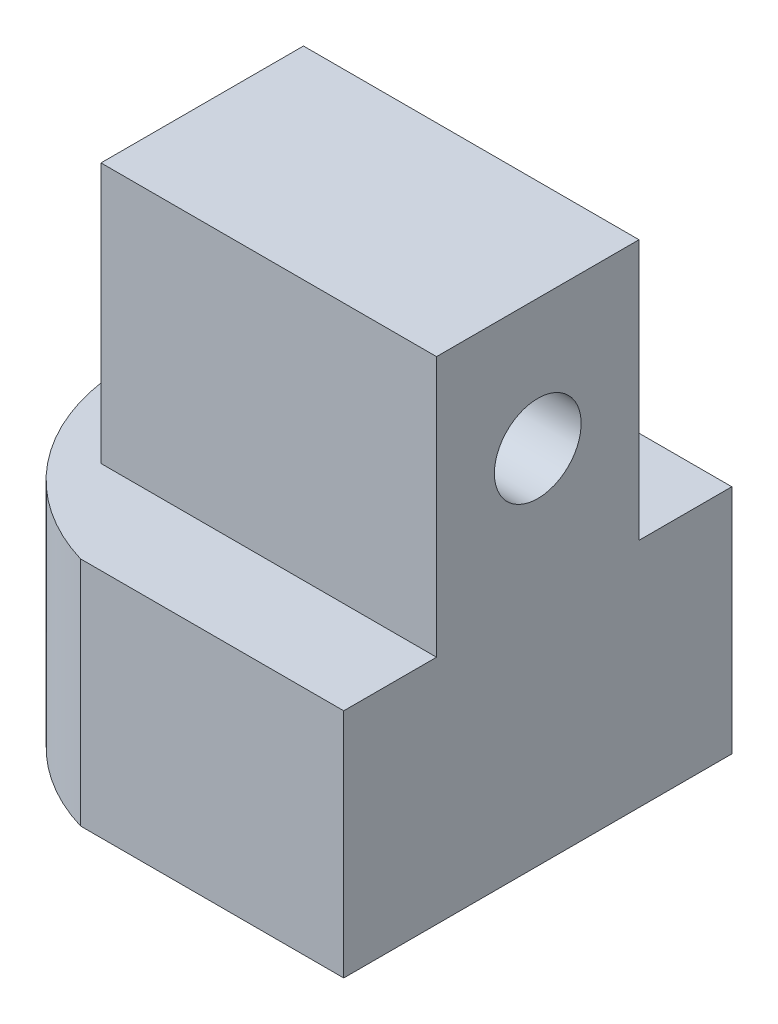
ISO-10303-21;
HEADER;
FILE_DESCRIPTION(('STEP AP214'),'2;1');
FILE_NAME('part.step','',(''),(''),'','','');
FILE_SCHEMA(('AUTOMOTIVE_DESIGN { 1 0 10303 214 1 1 1 1 }'));
ENDSEC;
DATA;
#1=APPLICATION_CONTEXT('core data for automotive mechanical design processes');
#2=APPLICATION_PROTOCOL_DEFINITION('international standard','automotive_design',2000,#1);
#3=PRODUCT_CONTEXT('',#1,'mechanical');
#4=PRODUCT('Part','Part','',(#3));
#5=PRODUCT_RELATED_PRODUCT_CATEGORY('part','',(#4));
#6=PRODUCT_DEFINITION_FORMATION('','',#4);
#7=PRODUCT_DEFINITION_CONTEXT('part definition',#1,'design');
#8=PRODUCT_DEFINITION('design','',#6,#7);
#9=PRODUCT_DEFINITION_SHAPE('','',#8);
#10=(LENGTH_UNIT() NAMED_UNIT(*) SI_UNIT(.MILLI.,.METRE.));
#11=(NAMED_UNIT(*) PLANE_ANGLE_UNIT() SI_UNIT($,.RADIAN.));
#12=(NAMED_UNIT(*) SI_UNIT($,.STERADIAN.) SOLID_ANGLE_UNIT());
#13=UNCERTAINTY_MEASURE_WITH_UNIT(LENGTH_MEASURE(1.E-05),#10,'distance_accuracy_value','');
#14=(GEOMETRIC_REPRESENTATION_CONTEXT(3) GLOBAL_UNCERTAINTY_ASSIGNED_CONTEXT((#13)) GLOBAL_UNIT_ASSIGNED_CONTEXT((#10,
#11,#12)) REPRESENTATION_CONTEXT('',''));
#15=CARTESIAN_POINT('',(0.,0.,0.));
#16=DIRECTION('',(0.,0.,1.));
#17=DIRECTION('',(1.,0.,0.));
#18=AXIS2_PLACEMENT_3D('',#15,#16,#17);
#19=CARTESIAN_POINT('',(0.,8.,0.));
#20=DIRECTION('',(0.,-1.,0.));
#21=DIRECTION('',(0.,0.,-1.));
#22=AXIS2_PLACEMENT_3D('',#19,#20,#21);
#23=PLANE('',#22);
#24=CARTESIAN_POINT('',(0.,8.,0.));
#25=DIRECTION('',(0.,1.,0.));
#26=DIRECTION('',(0.,0.,-1.));
#27=AXIS2_PLACEMENT_3D('',#24,#25,#26);
#28=CIRCLE('',#27,7.);
#29=CARTESIAN_POINT('',(-1.99999999999999,8.,-6.70820393249937));
#30=VERTEX_POINT('',#29);
#31=CARTESIAN_POINT('',(-1.99999999999999,8.,6.70820393249936));
#32=VERTEX_POINT('',#31);
#33=EDGE_CURVE('E149',#30,#32,#28,.T.);
#34=ORIENTED_EDGE('',*,*,#33,.T.);
#35=DIRECTION('',(1.,0.,0.));
#36=VECTOR('',#35,1.);
#37=CARTESIAN_POINT('',(2.,8.,6.70820393249937));
#38=LINE('',#37,#36);
#39=CARTESIAN_POINT('',(7.1,8.,6.70820393249937));
#40=VERTEX_POINT('',#39);
#41=EDGE_CURVE('E140',#32,#40,#38,.T.);
#42=ORIENTED_EDGE('',*,*,#41,.T.);
#43=DIRECTION('',(0.,0.,-1.));
#44=VECTOR('',#43,1.);
#45=CARTESIAN_POINT('',(7.1,8.,6.70820393249937));
#46=LINE('',#45,#44);
#47=CARTESIAN_POINT('',(7.1,8.,3.5));
#48=VERTEX_POINT('',#47);
#49=EDGE_CURVE('E251',#40,#48,#46,.T.);
#50=ORIENTED_EDGE('',*,*,#49,.T.);
#51=DIRECTION('',(1.,0.,0.));
#52=VECTOR('',#51,1.);
#53=CARTESIAN_POINT('',(-4.5,8.,3.5));
#54=LINE('',#53,#52);
#55=CARTESIAN_POINT('',(-4.5,8.,3.5));
#56=VERTEX_POINT('',#55);
#57=EDGE_CURVE('E51',#56,#48,#54,.T.);
#58=ORIENTED_EDGE('',*,*,#57,.F.);
#59=DIRECTION('',(0.,0.,1.));
#60=VECTOR('',#59,1.);
#61=CARTESIAN_POINT('',(-4.5,8.,3.5));
#62=LINE('',#61,#60);
#63=CARTESIAN_POINT('',(-4.5,8.,-3.5));
#64=VERTEX_POINT('',#63);
#65=EDGE_CURVE('E299',#64,#56,#62,.T.);
#66=ORIENTED_EDGE('',*,*,#65,.F.);
#67=DIRECTION('',(-1.,0.,0.));
#68=VECTOR('',#67,1.);
#69=CARTESIAN_POINT('',(-4.5,8.,-3.5));
#70=LINE('',#69,#68);
#71=CARTESIAN_POINT('',(7.1,8.,-3.5));
#72=VERTEX_POINT('',#71);
#73=EDGE_CURVE('E284',#72,#64,#70,.T.);
#74=ORIENTED_EDGE('',*,*,#73,.F.);
#75=CARTESIAN_POINT('',(7.1,8.,-6.70820393249937));
#76=VERTEX_POINT('',#75);
#77=EDGE_CURVE('E250',#72,#76,#46,.T.);
#78=ORIENTED_EDGE('',*,*,#77,.T.);
#79=DIRECTION('',(-1.,0.,0.));
#80=VECTOR('',#79,1.);
#81=CARTESIAN_POINT('',(7.1,8.,-6.70820393249937));
#82=LINE('',#81,#80);
#83=EDGE_CURVE('E253',#76,#30,#82,.T.);
#84=ORIENTED_EDGE('',*,*,#83,.T.);
#85=EDGE_LOOP('',(#34,#42,#50,#58,#66,#74,#78,#84));
#86=FACE_BOUND('',#85,.T.);
#87=ADVANCED_FACE('F36',(#86),#23,.F.);
#88=CARTESIAN_POINT('',(0.,0.,0.));
#89=DIRECTION('',(0.,1.,0.));
#90=DIRECTION('',(0.,0.,1.));
#91=AXIS2_PLACEMENT_3D('',#88,#89,#90);
#92=PLANE('',#91);
#93=DIRECTION('',(-1.,0.,0.));
#94=VECTOR('',#93,1.);
#95=CARTESIAN_POINT('',(2.,0.,6.70820393249937));
#96=LINE('',#95,#94);
#97=CARTESIAN_POINT('',(7.1,0.,6.70820393249937));
#98=VERTEX_POINT('',#97);
#99=CARTESIAN_POINT('',(-1.99999999999999,0.,6.70820393249936));
#100=VERTEX_POINT('',#99);
#101=EDGE_CURVE('E126',#98,#100,#96,.T.);
#102=ORIENTED_EDGE('',*,*,#101,.T.);
#103=CARTESIAN_POINT('',(0.,0.,0.));
#104=DIRECTION('',(0.,1.,0.));
#105=DIRECTION('',(0.,0.,1.));
#106=AXIS2_PLACEMENT_3D('',#103,#104,#105);
#107=CIRCLE('',#106,7.);
#108=CARTESIAN_POINT('',(-1.99999999999999,0.,-6.70820393249937));
#109=VERTEX_POINT('',#108);
#110=EDGE_CURVE('E12',#109,#100,#107,.T.);
#111=ORIENTED_EDGE('',*,*,#110,.F.);
#112=DIRECTION('',(1.,0.,0.));
#113=VECTOR('',#112,1.);
#114=CARTESIAN_POINT('',(7.1,0.,-6.70820393249937));
#115=LINE('',#114,#113);
#116=CARTESIAN_POINT('',(7.1,0.,-6.70820393249937));
#117=VERTEX_POINT('',#116);
#118=EDGE_CURVE('E134',#109,#117,#115,.T.);
#119=ORIENTED_EDGE('',*,*,#118,.T.);
#120=DIRECTION('',(0.,0.,1.));
#121=VECTOR('',#120,1.);
#122=CARTESIAN_POINT('',(7.1,0.,6.70820393249937));
#123=LINE('',#122,#121);
#124=EDGE_CURVE('E131',#117,#98,#123,.T.);
#125=ORIENTED_EDGE('',*,*,#124,.T.);
#126=EDGE_LOOP('',(#102,#111,#119,#125));
#127=FACE_BOUND('',#126,.T.);
#128=CARTESIAN_POINT('',(0.,0.,0.));
#129=DIRECTION('',(0.,1.,0.));
#130=DIRECTION('',(0.,0.,1.));
#131=AXIS2_PLACEMENT_3D('',#128,#129,#130);
#132=CIRCLE('',#131,4.);
#133=CARTESIAN_POINT('',(0.,0.,4.));
#134=VERTEX_POINT('',#133);
#135=EDGE_CURVE('E44',#134,#134,#132,.T.);
#136=ORIENTED_EDGE('',*,*,#135,.T.);
#137=EDGE_LOOP('',(#136));
#138=FACE_BOUND('',#137,.T.);
#139=ADVANCED_FACE('F128',(#127,#138),#92,.F.);
#140=CARTESIAN_POINT('',(0.,6.,0.));
#141=DIRECTION('',(0.,-1.,0.));
#142=DIRECTION('',(0.,0.,-1.));
#143=AXIS2_PLACEMENT_3D('',#140,#141,#142);
#144=CYLINDRICAL_SURFACE('',#143,7.);
#145=ORIENTED_EDGE('',*,*,#110,.T.);
#146=DIRECTION('',(0.,1.,0.));
#147=VECTOR('',#146,1.);
#148=CARTESIAN_POINT('',(-1.99999999999999,-6.40312423743285,6.70820393249936));
#149=LINE('',#148,#147);
#150=EDGE_CURVE('E137',#100,#32,#149,.T.);
#151=ORIENTED_EDGE('',*,*,#150,.T.);
#152=ORIENTED_EDGE('',*,*,#33,.F.);
#153=DIRECTION('',(0.,1.,0.));
#154=VECTOR('',#153,1.);
#155=CARTESIAN_POINT('',(-1.99999999999999,-6.40312423743285,-6.70820393249936));
#156=LINE('',#155,#154);
#157=EDGE_CURVE('E144',#109,#30,#156,.T.);
#158=ORIENTED_EDGE('',*,*,#157,.F.);
#159=EDGE_LOOP('',(#145,#151,#152,#158));
#160=FACE_BOUND('',#159,.T.);
#161=ADVANCED_FACE('F38',(#160),#144,.T.);
#162=CARTESIAN_POINT('',(0.,6.,0.));
#163=DIRECTION('',(0.,-1.,0.));
#164=DIRECTION('',(0.,0.,-1.));
#165=AXIS2_PLACEMENT_3D('',#162,#163,#164);
#166=CYLINDRICAL_SURFACE('',#165,4.);
#167=CARTESIAN_POINT('',(0.,6.,0.));
#168=DIRECTION('',(0.,1.,0.));
#169=DIRECTION('',(0.,0.,1.));
#170=AXIS2_PLACEMENT_3D('',#167,#168,#169);
#171=CIRCLE('',#170,4.);
#172=CARTESIAN_POINT('',(0.,6.,4.));
#173=VERTEX_POINT('',#172);
#174=EDGE_CURVE('E153',#173,#173,#171,.T.);
#175=ORIENTED_EDGE('',*,*,#174,.T.);
#176=EDGE_LOOP('',(#175));
#177=FACE_BOUND('',#176,.T.);
#178=ORIENTED_EDGE('',*,*,#135,.F.);
#179=EDGE_LOOP('',(#178));
#180=FACE_BOUND('',#179,.T.);
#181=ADVANCED_FACE('F161',(#177,#180),#166,.F.);
#182=CARTESIAN_POINT('',(0.,6.,0.));
#183=DIRECTION('',(0.,1.,0.));
#184=DIRECTION('',(0.,0.,1.));
#185=AXIS2_PLACEMENT_3D('',#182,#183,#184);
#186=PLANE('',#185);
#187=ORIENTED_EDGE('',*,*,#174,.F.);
#188=EDGE_LOOP('',(#187));
#189=FACE_BOUND('',#188,.T.);
#190=ADVANCED_FACE('F163',(#189),#186,.F.);
#191=CARTESIAN_POINT('',(-4.5,17.,-3.5));
#192=DIRECTION('',(0.,0.,1.));
#193=DIRECTION('',(1.,0.,0.));
#194=AXIS2_PLACEMENT_3D('',#191,#192,#193);
#195=PLANE('',#194);
#196=ORIENTED_EDGE('',*,*,#73,.T.);
#197=DIRECTION('',(0.,-1.,0.));
#198=VECTOR('',#197,1.);
#199=CARTESIAN_POINT('',(-4.5,17.,-3.5));
#200=LINE('',#199,#198);
#201=CARTESIAN_POINT('',(-4.5,17.,-3.5));
#202=VERTEX_POINT('',#201);
#203=EDGE_CURVE('E145',#202,#64,#200,.T.);
#204=ORIENTED_EDGE('',*,*,#203,.F.);
#205=DIRECTION('',(-1.,0.,0.));
#206=VECTOR('',#205,1.);
#207=CARTESIAN_POINT('',(-4.5,17.,-3.5));
#208=LINE('',#207,#206);
#209=CARTESIAN_POINT('',(7.1,17.,-3.5));
#210=VERTEX_POINT('',#209);
#211=EDGE_CURVE('E290',#210,#202,#208,.T.);
#212=ORIENTED_EDGE('',*,*,#211,.F.);
#213=DIRECTION('',(0.,1.,0.));
#214=VECTOR('',#213,1.);
#215=CARTESIAN_POINT('',(7.1,8.,-3.5));
#216=LINE('',#215,#214);
#217=EDGE_CURVE('E235',#72,#210,#216,.T.);
#218=ORIENTED_EDGE('',*,*,#217,.F.);
#219=EDGE_LOOP('',(#196,#204,#212,#218));
#220=FACE_BOUND('',#219,.T.);
#221=ADVANCED_FACE('F170',(#220),#195,.F.);
#222=CARTESIAN_POINT('',(-4.5,17.,3.5));
#223=DIRECTION('',(1.,0.,0.));
#224=DIRECTION('',(0.,0.,-1.));
#225=AXIS2_PLACEMENT_3D('',#222,#223,#224);
#226=PLANE('',#225);
#227=DIRECTION('',(0.,0.,1.));
#228=VECTOR('',#227,1.);
#229=CARTESIAN_POINT('',(-4.5,9.35,2.15));
#230=LINE('',#229,#228);
#231=CARTESIAN_POINT('',(-4.5,9.35,-2.15));
#232=VERTEX_POINT('',#231);
#233=CARTESIAN_POINT('',(-4.5,9.35,2.15));
#234=VERTEX_POINT('',#233);
#235=EDGE_CURVE('E274',#232,#234,#230,.T.);
#236=ORIENTED_EDGE('',*,*,#235,.F.);
#237=DIRECTION('',(0.,-1.,0.));
#238=VECTOR('',#237,1.);
#239=CARTESIAN_POINT('',(-4.5,9.35,-2.15));
#240=LINE('',#239,#238);
#241=CARTESIAN_POINT('',(-4.5,15.65,-2.15));
#242=VERTEX_POINT('',#241);
#243=EDGE_CURVE('E59',#242,#232,#240,.T.);
#244=ORIENTED_EDGE('',*,*,#243,.F.);
#245=DIRECTION('',(0.,0.,-1.));
#246=VECTOR('',#245,1.);
#247=CARTESIAN_POINT('',(-4.5,15.65,2.15));
#248=LINE('',#247,#246);
#249=CARTESIAN_POINT('',(-4.5,15.65,2.15));
#250=VERTEX_POINT('',#249);
#251=EDGE_CURVE('E263',#250,#242,#248,.T.);
#252=ORIENTED_EDGE('',*,*,#251,.F.);
#253=DIRECTION('',(0.,1.,0.));
#254=VECTOR('',#253,1.);
#255=CARTESIAN_POINT('',(-4.5,9.35,2.15));
#256=LINE('',#255,#254);
#257=EDGE_CURVE('E277',#234,#250,#256,.T.);
#258=ORIENTED_EDGE('',*,*,#257,.F.);
#259=EDGE_LOOP('',(#236,#244,#252,#258));
#260=FACE_BOUND('',#259,.T.);
#261=ORIENTED_EDGE('',*,*,#65,.T.);
#262=DIRECTION('',(0.,-1.,0.));
#263=VECTOR('',#262,1.);
#264=CARTESIAN_POINT('',(-4.5,17.,3.5));
#265=LINE('',#264,#263);
#266=CARTESIAN_POINT('',(-4.5,17.,3.5));
#267=VERTEX_POINT('',#266);
#268=EDGE_CURVE('E296',#267,#56,#265,.T.);
#269=ORIENTED_EDGE('',*,*,#268,.F.);
#270=DIRECTION('',(0.,0.,1.));
#271=VECTOR('',#270,1.);
#272=CARTESIAN_POINT('',(-4.5,17.,3.5));
#273=LINE('',#272,#271);
#274=EDGE_CURVE('E292',#202,#267,#273,.T.);
#275=ORIENTED_EDGE('',*,*,#274,.F.);
#276=ORIENTED_EDGE('',*,*,#203,.T.);
#277=EDGE_LOOP('',(#261,#269,#275,#276));
#278=FACE_BOUND('',#277,.T.);
#279=ADVANCED_FACE('F182',(#260,#278),#226,.F.);
#280=CARTESIAN_POINT('',(-4.5,17.,3.5));
#281=DIRECTION('',(0.,0.,-1.));
#282=DIRECTION('',(-1.,0.,0.));
#283=AXIS2_PLACEMENT_3D('',#280,#281,#282);
#284=PLANE('',#283);
#285=ORIENTED_EDGE('',*,*,#57,.T.);
#286=DIRECTION('',(0.,-1.,0.));
#287=VECTOR('',#286,1.);
#288=CARTESIAN_POINT('',(7.1,8.,3.5));
#289=LINE('',#288,#287);
#290=CARTESIAN_POINT('',(7.1,17.,3.5));
#291=VERTEX_POINT('',#290);
#292=EDGE_CURVE('E238',#291,#48,#289,.T.);
#293=ORIENTED_EDGE('',*,*,#292,.F.);
#294=DIRECTION('',(1.,0.,0.));
#295=VECTOR('',#294,1.);
#296=CARTESIAN_POINT('',(-4.5,17.,3.5));
#297=LINE('',#296,#295);
#298=EDGE_CURVE('E294',#267,#291,#297,.T.);
#299=ORIENTED_EDGE('',*,*,#298,.F.);
#300=ORIENTED_EDGE('',*,*,#268,.T.);
#301=EDGE_LOOP('',(#285,#293,#299,#300));
#302=FACE_BOUND('',#301,.T.);
#303=ADVANCED_FACE('F186',(#302),#284,.F.);
#304=CARTESIAN_POINT('',(0.,17.,0.));
#305=DIRECTION('',(0.,-1.,0.));
#306=DIRECTION('',(0.,0.,-1.));
#307=AXIS2_PLACEMENT_3D('',#304,#305,#306);
#308=PLANE('',#307);
#309=ORIENTED_EDGE('',*,*,#298,.T.);
#310=DIRECTION('',(0.,0.,1.));
#311=VECTOR('',#310,1.);
#312=CARTESIAN_POINT('',(7.1,17.,3.5));
#313=LINE('',#312,#311);
#314=EDGE_CURVE('E241',#210,#291,#313,.T.);
#315=ORIENTED_EDGE('',*,*,#314,.F.);
#316=ORIENTED_EDGE('',*,*,#211,.T.);
#317=ORIENTED_EDGE('',*,*,#274,.T.);
#318=EDGE_LOOP('',(#309,#315,#316,#317));
#319=FACE_BOUND('',#318,.T.);
#320=ADVANCED_FACE('F190',(#319),#308,.F.);
#321=CARTESIAN_POINT('',(1.5,9.35,-2.15));
#322=DIRECTION('',(0.,0.,-1.));
#323=DIRECTION('',(-1.,0.,0.));
#324=AXIS2_PLACEMENT_3D('',#321,#322,#323);
#325=PLANE('',#324);
#326=ORIENTED_EDGE('',*,*,#243,.T.);
#327=DIRECTION('',(-1.,0.,0.));
#328=VECTOR('',#327,1.);
#329=CARTESIAN_POINT('',(1.5,9.35,-2.15));
#330=LINE('',#329,#328);
#331=CARTESIAN_POINT('',(1.5,9.35,-2.15));
#332=VERTEX_POINT('',#331);
#333=EDGE_CURVE('E272',#332,#232,#330,.T.);
#334=ORIENTED_EDGE('',*,*,#333,.F.);
#335=DIRECTION('',(0.,-1.,0.));
#336=VECTOR('',#335,1.);
#337=CARTESIAN_POINT('',(1.5,9.35,-2.15));
#338=LINE('',#337,#336);
#339=CARTESIAN_POINT('',(1.5,15.65,-2.15));
#340=VERTEX_POINT('',#339);
#341=EDGE_CURVE('E259',#340,#332,#338,.T.);
#342=ORIENTED_EDGE('',*,*,#341,.F.);
#343=DIRECTION('',(-1.,0.,0.));
#344=VECTOR('',#343,1.);
#345=CARTESIAN_POINT('',(1.5,15.65,-2.15));
#346=LINE('',#345,#344);
#347=EDGE_CURVE('E282',#340,#242,#346,.T.);
#348=ORIENTED_EDGE('',*,*,#347,.T.);
#349=EDGE_LOOP('',(#326,#334,#342,#348));
#350=FACE_BOUND('',#349,.T.);
#351=ADVANCED_FACE('F193',(#350),#325,.F.);
#352=CARTESIAN_POINT('',(1.5,15.65,2.15));
#353=DIRECTION('',(0.,1.,0.));
#354=DIRECTION('',(0.,0.,1.));
#355=AXIS2_PLACEMENT_3D('',#352,#353,#354);
#356=PLANE('',#355);
#357=ORIENTED_EDGE('',*,*,#251,.T.);
#358=ORIENTED_EDGE('',*,*,#347,.F.);
#359=DIRECTION('',(0.,0.,-1.));
#360=VECTOR('',#359,1.);
#361=CARTESIAN_POINT('',(1.5,15.65,2.15));
#362=LINE('',#361,#360);
#363=CARTESIAN_POINT('',(1.5,15.65,2.15));
#364=VERTEX_POINT('',#363);
#365=EDGE_CURVE('E269',#364,#340,#362,.T.);
#366=ORIENTED_EDGE('',*,*,#365,.F.);
#367=DIRECTION('',(-1.,0.,0.));
#368=VECTOR('',#367,1.);
#369=CARTESIAN_POINT('',(1.5,15.65,2.15));
#370=LINE('',#369,#368);
#371=EDGE_CURVE('E285',#364,#250,#370,.T.);
#372=ORIENTED_EDGE('',*,*,#371,.T.);
#373=EDGE_LOOP('',(#357,#358,#366,#372));
#374=FACE_BOUND('',#373,.T.);
#375=ADVANCED_FACE('F197',(#374),#356,.F.);
#376=CARTESIAN_POINT('',(1.5,9.35,2.15));
#377=DIRECTION('',(0.,0.,1.));
#378=DIRECTION('',(1.,0.,0.));
#379=AXIS2_PLACEMENT_3D('',#376,#377,#378);
#380=PLANE('',#379);
#381=ORIENTED_EDGE('',*,*,#257,.T.);
#382=ORIENTED_EDGE('',*,*,#371,.F.);
#383=DIRECTION('',(0.,1.,0.));
#384=VECTOR('',#383,1.);
#385=CARTESIAN_POINT('',(1.5,9.35,2.15));
#386=LINE('',#385,#384);
#387=CARTESIAN_POINT('',(1.5,9.35,2.15));
#388=VERTEX_POINT('',#387);
#389=EDGE_CURVE('E266',#388,#364,#386,.T.);
#390=ORIENTED_EDGE('',*,*,#389,.F.);
#391=DIRECTION('',(-1.,0.,0.));
#392=VECTOR('',#391,1.);
#393=CARTESIAN_POINT('',(1.5,9.35,2.15));
#394=LINE('',#393,#392);
#395=EDGE_CURVE('E287',#388,#234,#394,.T.);
#396=ORIENTED_EDGE('',*,*,#395,.T.);
#397=EDGE_LOOP('',(#381,#382,#390,#396));
#398=FACE_BOUND('',#397,.T.);
#399=ADVANCED_FACE('F202',(#398),#380,.F.);
#400=CARTESIAN_POINT('',(1.5,9.35,2.15));
#401=DIRECTION('',(0.,-1.,0.));
#402=DIRECTION('',(0.,0.,-1.));
#403=AXIS2_PLACEMENT_3D('',#400,#401,#402);
#404=PLANE('',#403);
#405=ORIENTED_EDGE('',*,*,#235,.T.);
#406=ORIENTED_EDGE('',*,*,#395,.F.);
#407=DIRECTION('',(0.,0.,1.));
#408=VECTOR('',#407,1.);
#409=CARTESIAN_POINT('',(1.5,9.35,2.15));
#410=LINE('',#409,#408);
#411=EDGE_CURVE('E262',#332,#388,#410,.T.);
#412=ORIENTED_EDGE('',*,*,#411,.F.);
#413=ORIENTED_EDGE('',*,*,#333,.T.);
#414=EDGE_LOOP('',(#405,#406,#412,#413));
#415=FACE_BOUND('',#414,.T.);
#416=ADVANCED_FACE('F198',(#415),#404,.F.);
#417=CARTESIAN_POINT('',(1.5,0.,0.));
#418=DIRECTION('',(-1.,0.,0.));
#419=DIRECTION('',(0.,0.,1.));
#420=AXIS2_PLACEMENT_3D('',#417,#418,#419);
#421=PLANE('',#420);
#422=CARTESIAN_POINT('',(1.5,12.5,0.));
#423=DIRECTION('',(-1.,0.,0.));
#424=DIRECTION('',(0.,0.,1.));
#425=AXIS2_PLACEMENT_3D('',#422,#423,#424);
#426=CIRCLE('',#425,1.5);
#427=CARTESIAN_POINT('',(1.5,12.5,1.5));
#428=VERTEX_POINT('',#427);
#429=EDGE_CURVE('E233',#428,#428,#426,.T.);
#430=ORIENTED_EDGE('',*,*,#429,.F.);
#431=EDGE_LOOP('',(#430));
#432=FACE_BOUND('',#431,.T.);
#433=ORIENTED_EDGE('',*,*,#341,.T.);
#434=ORIENTED_EDGE('',*,*,#411,.T.);
#435=ORIENTED_EDGE('',*,*,#389,.T.);
#436=ORIENTED_EDGE('',*,*,#365,.T.);
#437=EDGE_LOOP('',(#433,#434,#435,#436));
#438=FACE_BOUND('',#437,.T.);
#439=ADVANCED_FACE('F201',(#432,#438),#421,.T.);
#440=CARTESIAN_POINT('',(7.1,-14.3530484566868,-6.70820393249937));
#441=DIRECTION('',(0.,0.,-1.));
#442=DIRECTION('',(-1.,0.,0.));
#443=AXIS2_PLACEMENT_3D('',#440,#441,#442);
#444=PLANE('',#443);
#445=ORIENTED_EDGE('',*,*,#118,.F.);
#446=ORIENTED_EDGE('',*,*,#157,.T.);
#447=ORIENTED_EDGE('',*,*,#83,.F.);
#448=DIRECTION('',(0.,1.,0.));
#449=VECTOR('',#448,1.);
#450=CARTESIAN_POINT('',(7.1,-14.3530484566868,-6.70820393249937));
#451=LINE('',#450,#449);
#452=EDGE_CURVE('E247',#117,#76,#451,.T.);
#453=ORIENTED_EDGE('',*,*,#452,.F.);
#454=EDGE_LOOP('',(#445,#446,#447,#453));
#455=FACE_BOUND('',#454,.T.);
#456=ADVANCED_FACE('F212',(#455),#444,.T.);
#457=CARTESIAN_POINT('',(7.1,-14.3530484566868,6.70820393249937));
#458=DIRECTION('',(1.,0.,0.));
#459=DIRECTION('',(0.,0.,-1.));
#460=AXIS2_PLACEMENT_3D('',#457,#458,#459);
#461=PLANE('',#460);
#462=CARTESIAN_POINT('',(7.1,12.5,0.));
#463=DIRECTION('',(-1.,0.,0.));
#464=DIRECTION('',(0.,0.,1.));
#465=AXIS2_PLACEMENT_3D('',#462,#463,#464);
#466=CIRCLE('',#465,1.5);
#467=CARTESIAN_POINT('',(7.1,12.5,1.5));
#468=VERTEX_POINT('',#467);
#469=EDGE_CURVE('E230',#468,#468,#466,.T.);
#470=ORIENTED_EDGE('',*,*,#469,.T.);
#471=EDGE_LOOP('',(#470));
#472=FACE_BOUND('',#471,.T.);
#473=ORIENTED_EDGE('',*,*,#124,.F.);
#474=ORIENTED_EDGE('',*,*,#452,.T.);
#475=ORIENTED_EDGE('',*,*,#77,.F.);
#476=ORIENTED_EDGE('',*,*,#217,.T.);
#477=ORIENTED_EDGE('',*,*,#314,.T.);
#478=ORIENTED_EDGE('',*,*,#292,.T.);
#479=ORIENTED_EDGE('',*,*,#49,.F.);
#480=DIRECTION('',(0.,1.,0.));
#481=VECTOR('',#480,1.);
#482=CARTESIAN_POINT('',(7.1,-14.3530484566868,6.70820393249937));
#483=LINE('',#482,#481);
#484=EDGE_CURVE('E255',#98,#40,#483,.T.);
#485=ORIENTED_EDGE('',*,*,#484,.F.);
#486=EDGE_LOOP('',(#473,#474,#475,#476,#477,#478,#479,#485));
#487=FACE_BOUND('',#486,.T.);
#488=ADVANCED_FACE('F217',(#472,#487),#461,.T.);
#489=CARTESIAN_POINT('',(2.,-14.3530484566868,6.70820393249937));
#490=DIRECTION('',(0.,0.,1.));
#491=DIRECTION('',(1.,0.,0.));
#492=AXIS2_PLACEMENT_3D('',#489,#490,#491);
#493=PLANE('',#492);
#494=ORIENTED_EDGE('',*,*,#101,.F.);
#495=ORIENTED_EDGE('',*,*,#484,.T.);
#496=ORIENTED_EDGE('',*,*,#41,.F.);
#497=ORIENTED_EDGE('',*,*,#150,.F.);
#498=EDGE_LOOP('',(#494,#495,#496,#497));
#499=FACE_BOUND('',#498,.T.);
#500=ADVANCED_FACE('F138',(#499),#493,.T.);
#501=CARTESIAN_POINT('',(7.1,12.5,0.));
#502=DIRECTION('',(-1.,0.,0.));
#503=DIRECTION('',(0.,0.,1.));
#504=AXIS2_PLACEMENT_3D('',#501,#502,#503);
#505=CYLINDRICAL_SURFACE('',#504,1.5);
#506=ORIENTED_EDGE('',*,*,#469,.F.);
#507=EDGE_LOOP('',(#506));
#508=FACE_BOUND('',#507,.T.);
#509=ORIENTED_EDGE('',*,*,#429,.T.);
#510=EDGE_LOOP('',(#509));
#511=FACE_BOUND('',#510,.T.);
#512=ADVANCED_FACE('F216',(#508,#511),#505,.F.);
#513=CLOSED_SHELL('',(#87,#139,#161,#181,#190,#221,#279,#303,#320,#351,#375,#399,#416,#439,#456,
#488,#500,#512));
#514=MANIFOLD_SOLID_BREP('B2',#513);
#515=ADVANCED_BREP_SHAPE_REPRESENTATION('',(#18,#514),#14);
#516=SHAPE_DEFINITION_REPRESENTATION(#9,#515);
ENDSEC;
END-ISO-10303-21;
